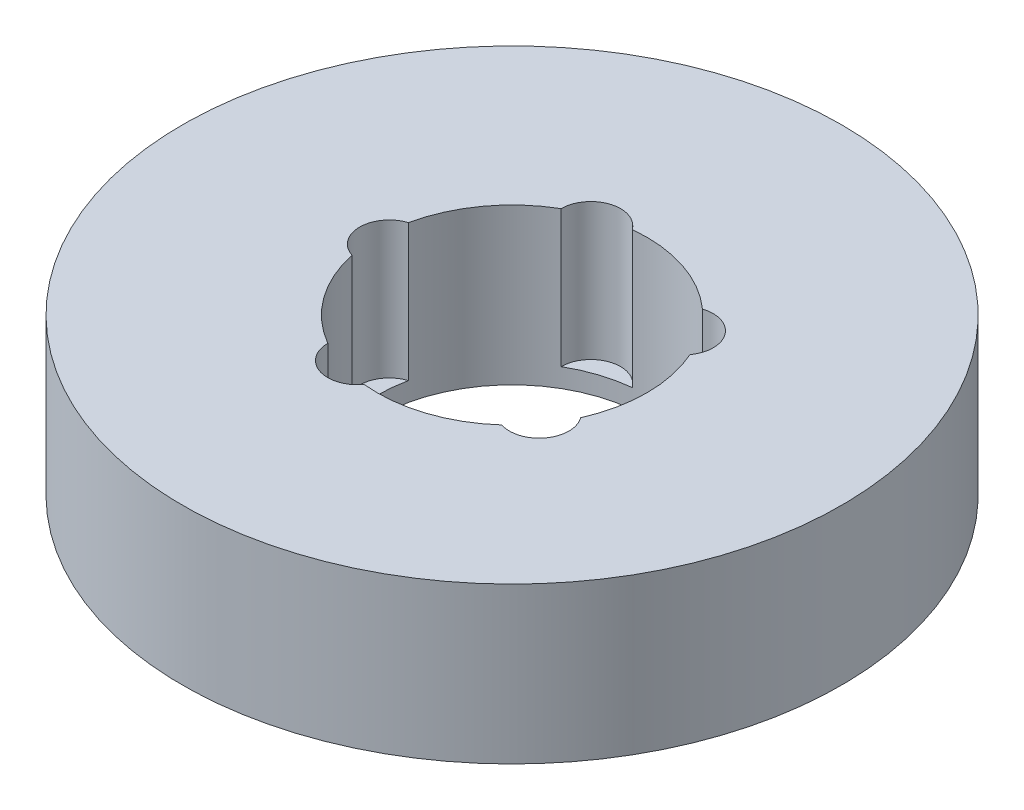
ISO-10303-21;
HEADER;
FILE_DESCRIPTION(('STEP AP214'),'2;1');
FILE_NAME('part.step','',(''),(''),'','','');
FILE_SCHEMA(('AUTOMOTIVE_DESIGN { 1 0 10303 214 1 1 1 1 }'));
ENDSEC;
DATA;
#1=APPLICATION_CONTEXT('core data for automotive mechanical design processes');
#2=APPLICATION_PROTOCOL_DEFINITION('international standard','automotive_design',2000,#1);
#3=PRODUCT_CONTEXT('',#1,'mechanical');
#4=PRODUCT('Part','Part','',(#3));
#5=PRODUCT_RELATED_PRODUCT_CATEGORY('part','',(#4));
#6=PRODUCT_DEFINITION_FORMATION('','',#4);
#7=PRODUCT_DEFINITION_CONTEXT('part definition',#1,'design');
#8=PRODUCT_DEFINITION('design','',#6,#7);
#9=PRODUCT_DEFINITION_SHAPE('','',#8);
#10=(LENGTH_UNIT() NAMED_UNIT(*) SI_UNIT(.MILLI.,.METRE.));
#11=(NAMED_UNIT(*) PLANE_ANGLE_UNIT() SI_UNIT($,.RADIAN.));
#12=(NAMED_UNIT(*) SI_UNIT($,.STERADIAN.) SOLID_ANGLE_UNIT());
#13=UNCERTAINTY_MEASURE_WITH_UNIT(LENGTH_MEASURE(1.E-05),#10,'distance_accuracy_value','');
#14=(GEOMETRIC_REPRESENTATION_CONTEXT(3) GLOBAL_UNCERTAINTY_ASSIGNED_CONTEXT((#13)) GLOBAL_UNIT_ASSIGNED_CONTEXT((#10,
#11,#12)) REPRESENTATION_CONTEXT('',''));
#15=CARTESIAN_POINT('',(0.,0.,0.));
#16=DIRECTION('',(0.,0.,1.));
#17=DIRECTION('',(1.,0.,0.));
#18=AXIS2_PLACEMENT_3D('',#15,#16,#17);
#19=CARTESIAN_POINT('',(0.,26.,0.));
#20=DIRECTION('',(0.,-1.,0.));
#21=DIRECTION('',(0.,0.,-1.));
#22=AXIS2_PLACEMENT_3D('',#19,#20,#21);
#23=CYLINDRICAL_SURFACE('',#22,55.);
#24=CARTESIAN_POINT('',(0.,26.,0.));
#25=DIRECTION('',(0.,1.,0.));
#26=DIRECTION('',(0.,0.,1.));
#27=AXIS2_PLACEMENT_3D('',#24,#25,#26);
#28=CIRCLE('',#27,55.);
#29=CARTESIAN_POINT('',(0.,26.,-55.));
#30=VERTEX_POINT('',#29);
#31=EDGE_CURVE('E151',#30,#30,#28,.T.);
#32=CARTESIAN_POINT('',(0.,0.,0.));
#33=DIRECTION('',(0.,1.,0.));
#34=DIRECTION('',(0.,0.,1.));
#35=AXIS2_PLACEMENT_3D('',#32,#33,#34);
#36=CIRCLE('',#35,55.);
#37=CARTESIAN_POINT('',(0.,0.,-55.));
#38=VERTEX_POINT('',#37);
#39=EDGE_CURVE('E150',#38,#38,#36,.T.);
#40=CARTESIAN_POINT('',(0.,26.,-55.));
#41=CARTESIAN_POINT('',(0.,25.7291666666667,-55.));
#42=CARTESIAN_POINT('',(0.,25.4583333333333,-55.));
#43=CARTESIAN_POINT('',(0.,24.9166666666667,-55.));
#44=CARTESIAN_POINT('',(0.,24.6458333333333,-55.));
#45=CARTESIAN_POINT('',(0.,24.1041666666667,-55.));
#46=CARTESIAN_POINT('',(0.,23.8333333333333,-55.));
#47=CARTESIAN_POINT('',(0.,23.2916666666667,-55.));
#48=CARTESIAN_POINT('',(0.,23.0208333333333,-55.));
#49=CARTESIAN_POINT('',(0.,22.4791666666667,-55.));
#50=CARTESIAN_POINT('',(0.,22.2083333333333,-55.));
#51=CARTESIAN_POINT('',(0.,21.6666666666667,-55.));
#52=CARTESIAN_POINT('',(0.,21.3958333333333,-55.));
#53=CARTESIAN_POINT('',(0.,20.8541666666667,-55.));
#54=CARTESIAN_POINT('',(0.,20.5833333333333,-55.));
#55=CARTESIAN_POINT('',(0.,20.0416666666667,-55.));
#56=CARTESIAN_POINT('',(0.,19.7708333333333,-55.));
#57=CARTESIAN_POINT('',(0.,19.2291666666667,-55.));
#58=CARTESIAN_POINT('',(0.,18.9583333333333,-55.));
#59=CARTESIAN_POINT('',(0.,18.4166666666667,-55.));
#60=CARTESIAN_POINT('',(0.,18.1458333333333,-55.));
#61=CARTESIAN_POINT('',(0.,17.6041666666667,-55.));
#62=CARTESIAN_POINT('',(0.,17.3333333333333,-55.));
#63=CARTESIAN_POINT('',(0.,16.7916666666667,-55.));
#64=CARTESIAN_POINT('',(0.,16.5208333333333,-55.));
#65=CARTESIAN_POINT('',(0.,15.9791666666667,-55.));
#66=CARTESIAN_POINT('',(0.,15.7083333333333,-55.));
#67=CARTESIAN_POINT('',(0.,15.1666666666667,-55.));
#68=CARTESIAN_POINT('',(0.,14.8958333333333,-55.));
#69=CARTESIAN_POINT('',(0.,14.3541666666667,-55.));
#70=CARTESIAN_POINT('',(0.,14.0833333333333,-55.));
#71=CARTESIAN_POINT('',(0.,13.5416666666667,-55.));
#72=CARTESIAN_POINT('',(0.,13.2708333333333,-55.));
#73=CARTESIAN_POINT('',(0.,12.7291666666667,-55.));
#74=CARTESIAN_POINT('',(0.,12.4583333333333,-55.));
#75=CARTESIAN_POINT('',(0.,11.9166666666667,-55.));
#76=CARTESIAN_POINT('',(0.,11.6458333333333,-55.));
#77=CARTESIAN_POINT('',(0.,11.1041666666667,-55.));
#78=CARTESIAN_POINT('',(0.,10.8333333333333,-55.));
#79=CARTESIAN_POINT('',(0.,10.2916666666667,-55.));
#80=CARTESIAN_POINT('',(0.,10.0208333333333,-55.));
#81=CARTESIAN_POINT('',(0.,9.47916666666667,-55.));
#82=CARTESIAN_POINT('',(0.,9.20833333333333,-55.));
#83=CARTESIAN_POINT('',(0.,8.66666666666667,-55.));
#84=CARTESIAN_POINT('',(0.,8.39583333333333,-55.));
#85=CARTESIAN_POINT('',(0.,7.85416666666667,-55.));
#86=CARTESIAN_POINT('',(0.,7.58333333333333,-55.));
#87=CARTESIAN_POINT('',(0.,7.04166666666667,-55.));
#88=CARTESIAN_POINT('',(0.,6.77083333333333,-55.));
#89=CARTESIAN_POINT('',(0.,6.22916666666667,-55.));
#90=CARTESIAN_POINT('',(0.,5.95833333333333,-55.));
#91=CARTESIAN_POINT('',(0.,5.41666666666667,-55.));
#92=CARTESIAN_POINT('',(0.,5.14583333333333,-55.));
#93=CARTESIAN_POINT('',(0.,4.60416666666667,-55.));
#94=CARTESIAN_POINT('',(0.,4.33333333333333,-55.));
#95=CARTESIAN_POINT('',(0.,3.79166666666667,-55.));
#96=CARTESIAN_POINT('',(0.,3.52083333333333,-55.));
#97=CARTESIAN_POINT('',(0.,2.97916666666667,-55.));
#98=CARTESIAN_POINT('',(0.,2.70833333333333,-55.));
#99=CARTESIAN_POINT('',(0.,2.16666666666667,-55.));
#100=CARTESIAN_POINT('',(0.,1.89583333333333,-55.));
#101=CARTESIAN_POINT('',(0.,1.35416666666667,-55.));
#102=CARTESIAN_POINT('',(0.,1.08333333333333,-55.));
#103=CARTESIAN_POINT('',(0.,0.541666666666667,-55.));
#104=CARTESIAN_POINT('',(0.,0.270833333333334,-55.));
#105=CARTESIAN_POINT('',(0.,0.,-55.));
#106=B_SPLINE_CURVE_WITH_KNOTS('',3,(#40,#41,#42,#43,#44,#45,#46,#47,#48,#49,#50,#51,#52,#53,
#54,#55,#56,#57,#58,#59,#60,#61,#62,#63,#64,#65,#66,#67,#68,#69,#70,#71,#72,#73,#74,#75,#76,#77,
#78,#79,#80,#81,#82,#83,#84,#85,#86,#87,#88,#89,#90,#91,#92,#93,#94,#95,#96,#97,#98,#99,#100,
#101,#102,#103,#104,#105),.UNSPECIFIED.,.F.,.F.,(4,2,2,2,2,2,2,2,2,2,2,2,2,2,2,2,2,2,2,2,2,2,2,
2,2,2,2,2,2,2,2,2,4),(0.,0.812500000000001,1.625,2.4375,3.25,4.0625,4.875,5.6875,6.5,7.3125,
8.125,8.9375,9.75,10.5625,11.375,12.1875,13.,13.8125,14.625,15.4375,16.25,17.0625,17.875,
18.6875,19.5,20.3125,21.125,21.9375,22.75,23.5625,24.375,25.1875,26.),.UNSPECIFIED.);
#107=EDGE_CURVE('BSEAM39',#30,#38,#106,.T.);
#108=ORIENTED_EDGE('',*,*,#31,.F.);
#109=ORIENTED_EDGE('',*,*,#39,.T.);
#110=ORIENTED_EDGE('',*,*,#107,.T.);
#111=ORIENTED_EDGE('',*,*,#107,.F.);
#112=EDGE_LOOP('',(#108,#110,#109,#111));
#113=FACE_BOUND('',#112,.T.);
#114=ADVANCED_FACE('F39',(#113),#23,.T.);
#115=CARTESIAN_POINT('',(0.,26.,0.));
#116=DIRECTION('',(0.,1.,0.));
#117=DIRECTION('',(0.,0.,1.));
#118=AXIS2_PLACEMENT_3D('',#115,#116,#117);
#119=PLANE('',#118);
#120=CARTESIAN_POINT('',(-6.33052670048163,26.,-19.4833578077199));
#121=DIRECTION('',(0.,1.,0.));
#122=DIRECTION('',(-0.95105651629515,0.,0.309016994374958));
#123=AXIS2_PLACEMENT_3D('',#120,#121,#122);
#124=CIRCLE('',#123,4.94975318121783);
#125=CARTESIAN_POINT('',(-2.31712644491207,26.,-22.3803691890525));
#126=VERTEX_POINT('',#125);
#127=CARTESIAN_POINT('',(-11.2802562781369,26.,-19.4680717663449));
#128=VERTEX_POINT('',#127);
#129=EDGE_CURVE('E196',#126,#128,#124,.T.);
#130=ORIENTED_EDGE('',*,*,#129,.F.);
#131=CARTESIAN_POINT('',(0.,26.,0.));
#132=DIRECTION('',(0.,1.,0.));
#133=DIRECTION('',(0.,0.,1.));
#134=AXIS2_PLACEMENT_3D('',#131,#132,#133);
#135=CIRCLE('',#134,22.5);
#136=CARTESIAN_POINT('',(15.029445622235,26.,-16.744126262313));
#137=VERTEX_POINT('',#136);
#138=EDGE_CURVE('E156',#137,#126,#135,.T.);
#139=ORIENTED_EDGE('',*,*,#138,.F.);
#140=CARTESIAN_POINT('',(16.5735340685489,26.,-12.0413773401468));
#141=DIRECTION('',(0.,1.,0.));
#142=DIRECTION('',(-0.58778525229248,0.,-0.809016994374942));
#143=AXIS2_PLACEMENT_3D('',#140,#141,#142);
#144=CIRCLE('',#143,4.94975318121783);
#145=CARTESIAN_POINT('',(20.5689645047462,26.,-9.11963262431607));
#146=VERTEX_POINT('',#145);
#147=EDGE_CURVE('E254',#146,#137,#144,.T.);
#148=ORIENTED_EDGE('',*,*,#147,.F.);
#149=CARTESIAN_POINT('',(20.5689645047464,26.,9.11963262431577));
#150=VERTEX_POINT('',#149);
#151=EDGE_CURVE('E153',#150,#146,#135,.T.);
#152=ORIENTED_EDGE('',*,*,#151,.F.);
#153=CARTESIAN_POINT('',(16.5735340685491,26.,12.0413773401465));
#154=DIRECTION('',(0.,1.,0.));
#155=DIRECTION('',(0.587785252292469,0.,-0.809016994374951));
#156=AXIS2_PLACEMENT_3D('',#153,#154,#155);
#157=CIRCLE('',#156,4.94975318121783);
#158=CARTESIAN_POINT('',(15.0294456222353,26.,16.7441262623128));
#159=VERTEX_POINT('',#158);
#160=EDGE_CURVE('E248',#159,#150,#157,.T.);
#161=ORIENTED_EDGE('',*,*,#160,.F.);
#162=CARTESIAN_POINT('',(-2.31712644491175,26.,22.3803691890525));
#163=VERTEX_POINT('',#162);
#164=EDGE_CURVE('E140',#163,#159,#135,.T.);
#165=ORIENTED_EDGE('',*,*,#164,.F.);
#166=CARTESIAN_POINT('',(-6.33052670048136,26.,19.48335780772));
#167=DIRECTION('',(0.,1.,0.));
#168=DIRECTION('',(0.951056516295155,0.,0.309016994374945));
#169=AXIS2_PLACEMENT_3D('',#166,#167,#168);
#170=CIRCLE('',#169,4.94975318121783);
#171=CARTESIAN_POINT('',(-11.2802562781366,26.,19.468071766345));
#172=VERTEX_POINT('',#171);
#173=EDGE_CURVE('E117',#172,#163,#170,.T.);
#174=ORIENTED_EDGE('',*,*,#173,.F.);
#175=CARTESIAN_POINT('',(-22.001027403933,26.,4.71219621528948));
#176=VERTEX_POINT('',#175);
#177=EDGE_CURVE('E133',#176,#172,#135,.T.);
#178=ORIENTED_EDGE('',*,*,#177,.F.);
#179=CARTESIAN_POINT('',(-20.4860147361353,26.,0.));
#180=DIRECTION('',(0.,1.,0.));
#181=DIRECTION('',(0.,0.,1.));
#182=AXIS2_PLACEMENT_3D('',#179,#180,#181);
#183=CIRCLE('',#182,4.94975318121783);
#184=CARTESIAN_POINT('',(-22.001027403933,26.,-4.71219621528948));
#185=VERTEX_POINT('',#184);
#186=EDGE_CURVE('E170',#185,#176,#183,.T.);
#187=ORIENTED_EDGE('',*,*,#186,.F.);
#188=EDGE_CURVE('E149',#128,#185,#135,.T.);
#189=ORIENTED_EDGE('',*,*,#188,.F.);
#190=EDGE_LOOP('',(#130,#139,#148,#152,#161,#165,#174,#178,#187,#189));
#191=FACE_BOUND('',#190,.T.);
#192=ORIENTED_EDGE('',*,*,#31,.T.);
#193=EDGE_LOOP('',(#192));
#194=FACE_BOUND('',#193,.T.);
#195=ADVANCED_FACE('F131',(#191,#194),#119,.T.);
#196=CARTESIAN_POINT('',(0.,0.,0.));
#197=DIRECTION('',(0.,1.,0.));
#198=DIRECTION('',(0.,0.,1.));
#199=AXIS2_PLACEMENT_3D('',#196,#197,#198);
#200=PLANE('',#199);
#201=CARTESIAN_POINT('',(0.,0.,0.));
#202=DIRECTION('',(0.,1.,0.));
#203=DIRECTION('',(0.,0.,1.));
#204=AXIS2_PLACEMENT_3D('',#201,#202,#203);
#205=CIRCLE('',#204,22.5);
#206=CARTESIAN_POINT('',(0.,0.,22.5));
#207=VERTEX_POINT('',#206);
#208=EDGE_CURVE('E160',#207,#207,#205,.T.);
#209=ORIENTED_EDGE('',*,*,#208,.T.);
#210=EDGE_LOOP('',(#209));
#211=FACE_BOUND('',#210,.T.);
#212=ORIENTED_EDGE('',*,*,#39,.F.);
#213=EDGE_LOOP('',(#212));
#214=FACE_BOUND('',#213,.T.);
#215=ADVANCED_FACE('F212',(#211,#214),#200,.F.);
#216=CARTESIAN_POINT('',(0.,26.,0.));
#217=DIRECTION('',(0.,-1.,0.));
#218=DIRECTION('',(0.,0.,-1.));
#219=AXIS2_PLACEMENT_3D('',#216,#217,#218);
#220=CYLINDRICAL_SURFACE('',#219,22.5);
#221=DIRECTION('',(0.,1.,0.));
#222=VECTOR('',#221,1.);
#223=CARTESIAN_POINT('',(-2.31712644491207,14.5820139163583,-22.3803691890525));
#224=LINE('',#223,#222);
#225=CARTESIAN_POINT('',(-2.31712644491207,3.16402783271657,-22.3803691890525));
#226=VERTEX_POINT('',#225);
#227=EDGE_CURVE('E11',#226,#126,#224,.T.);
#228=ORIENTED_EDGE('',*,*,#227,.F.);
#229=CARTESIAN_POINT('',(0.,3.16402783271657,0.));
#230=DIRECTION('',(0.,1.,0.));
#231=DIRECTION('',(0.,0.,1.));
#232=AXIS2_PLACEMENT_3D('',#229,#230,#231);
#233=CIRCLE('',#232,22.5);
#234=CARTESIAN_POINT('',(-11.2802562781369,3.16402783271657,-19.4680717663449));
#235=VERTEX_POINT('',#234);
#236=EDGE_CURVE('E193',#226,#235,#233,.T.);
#237=ORIENTED_EDGE('',*,*,#236,.T.);
#238=DIRECTION('',(0.,1.,0.));
#239=VECTOR('',#238,1.);
#240=CARTESIAN_POINT('',(-11.2802562781369,14.5820139163583,-19.4680717663449));
#241=LINE('',#240,#239);
#242=EDGE_CURVE('E46',#128,#235,#241,.F.);
#243=ORIENTED_EDGE('',*,*,#242,.F.);
#244=ORIENTED_EDGE('',*,*,#188,.T.);
#245=DIRECTION('',(0.,1.,0.));
#246=VECTOR('',#245,1.);
#247=CARTESIAN_POINT('',(-22.001027403933,14.5820139163583,-4.71219621528948));
#248=LINE('',#247,#246);
#249=CARTESIAN_POINT('',(-22.001027403933,3.16402783271657,-4.71219621528948));
#250=VERTEX_POINT('',#249);
#251=EDGE_CURVE('E174',#250,#185,#248,.T.);
#252=ORIENTED_EDGE('',*,*,#251,.F.);
#253=CARTESIAN_POINT('',(0.,3.16402783271657,0.));
#254=DIRECTION('',(0.,1.,0.));
#255=DIRECTION('',(0.,0.,1.));
#256=AXIS2_PLACEMENT_3D('',#253,#254,#255);
#257=CIRCLE('',#256,22.5);
#258=CARTESIAN_POINT('',(-22.001027403933,3.16402783271657,4.71219621528948));
#259=VERTEX_POINT('',#258);
#260=EDGE_CURVE('E171',#250,#259,#257,.T.);
#261=ORIENTED_EDGE('',*,*,#260,.T.);
#262=DIRECTION('',(0.,1.,0.));
#263=VECTOR('',#262,1.);
#264=CARTESIAN_POINT('',(-22.001027403933,14.5820139163583,4.71219621528948));
#265=LINE('',#264,#263);
#266=EDGE_CURVE('E148',#176,#259,#265,.F.);
#267=ORIENTED_EDGE('',*,*,#266,.F.);
#268=ORIENTED_EDGE('',*,*,#177,.T.);
#269=DIRECTION('',(0.,1.,0.));
#270=VECTOR('',#269,1.);
#271=CARTESIAN_POINT('',(-11.2802562781366,14.5820139163583,19.468071766345));
#272=LINE('',#271,#270);
#273=CARTESIAN_POINT('',(-11.2802562781366,3.16402783271657,19.468071766345));
#274=VERTEX_POINT('',#273);
#275=EDGE_CURVE('E111',#274,#172,#272,.T.);
#276=ORIENTED_EDGE('',*,*,#275,.F.);
#277=CARTESIAN_POINT('',(0.,3.16402783271657,0.));
#278=DIRECTION('',(0.,1.,0.));
#279=DIRECTION('',(0.,0.,1.));
#280=AXIS2_PLACEMENT_3D('',#277,#278,#279);
#281=CIRCLE('',#280,22.5);
#282=CARTESIAN_POINT('',(-2.31712644491175,3.16402783271657,22.3803691890525));
#283=VERTEX_POINT('',#282);
#284=EDGE_CURVE('E180',#274,#283,#281,.T.);
#285=ORIENTED_EDGE('',*,*,#284,.T.);
#286=DIRECTION('',(0.,1.,0.));
#287=VECTOR('',#286,1.);
#288=CARTESIAN_POINT('',(-2.31712644491175,14.5820139163583,22.3803691890525));
#289=LINE('',#288,#287);
#290=EDGE_CURVE('E124',#163,#283,#289,.F.);
#291=ORIENTED_EDGE('',*,*,#290,.F.);
#292=ORIENTED_EDGE('',*,*,#164,.T.);
#293=DIRECTION('',(0.,1.,0.));
#294=VECTOR('',#293,1.);
#295=CARTESIAN_POINT('',(15.0294456222353,14.5820139163583,16.7441262623128));
#296=LINE('',#295,#294);
#297=CARTESIAN_POINT('',(15.0294456222353,3.16402783271657,16.7441262623128));
#298=VERTEX_POINT('',#297);
#299=EDGE_CURVE('E183',#298,#159,#296,.T.);
#300=ORIENTED_EDGE('',*,*,#299,.F.);
#301=CARTESIAN_POINT('',(0.,3.16402783271657,0.));
#302=DIRECTION('',(0.,1.,0.));
#303=DIRECTION('',(0.,0.,1.));
#304=AXIS2_PLACEMENT_3D('',#301,#302,#303);
#305=CIRCLE('',#304,22.5);
#306=CARTESIAN_POINT('',(20.5689645047464,3.16402783271657,9.11963262431577));
#307=VERTEX_POINT('',#306);
#308=EDGE_CURVE('E123',#298,#307,#305,.T.);
#309=ORIENTED_EDGE('',*,*,#308,.T.);
#310=DIRECTION('',(0.,1.,0.));
#311=VECTOR('',#310,1.);
#312=CARTESIAN_POINT('',(20.5689645047464,14.5820139163583,9.11963262431577));
#313=LINE('',#312,#311);
#314=EDGE_CURVE('E185',#150,#307,#313,.F.);
#315=ORIENTED_EDGE('',*,*,#314,.F.);
#316=ORIENTED_EDGE('',*,*,#151,.T.);
#317=DIRECTION('',(0.,1.,0.));
#318=VECTOR('',#317,1.);
#319=CARTESIAN_POINT('',(20.5689645047462,14.5820139163583,-9.11963262431607));
#320=LINE('',#319,#318);
#321=CARTESIAN_POINT('',(20.5689645047462,3.16402783271657,-9.11963262431607));
#322=VERTEX_POINT('',#321);
#323=EDGE_CURVE('E195',#322,#146,#320,.T.);
#324=ORIENTED_EDGE('',*,*,#323,.F.);
#325=CARTESIAN_POINT('',(0.,3.16402783271657,0.));
#326=DIRECTION('',(0.,1.,0.));
#327=DIRECTION('',(0.,0.,1.));
#328=AXIS2_PLACEMENT_3D('',#325,#326,#327);
#329=CIRCLE('',#328,22.5);
#330=CARTESIAN_POINT('',(15.029445622235,3.16402783271657,-16.744126262313));
#331=VERTEX_POINT('',#330);
#332=EDGE_CURVE('E190',#322,#331,#329,.T.);
#333=ORIENTED_EDGE('',*,*,#332,.T.);
#334=DIRECTION('',(0.,1.,0.));
#335=VECTOR('',#334,1.);
#336=CARTESIAN_POINT('',(15.029445622235,14.5820139163583,-16.744126262313));
#337=LINE('',#336,#335);
#338=EDGE_CURVE('E189',#137,#331,#337,.F.);
#339=ORIENTED_EDGE('',*,*,#338,.F.);
#340=ORIENTED_EDGE('',*,*,#138,.T.);
#341=EDGE_LOOP('',(#228,#237,#243,#244,#252,#261,#267,#268,#276,#285,#291,#292,#300,#309,#315,
#316,#324,#333,#339,#340));
#342=FACE_BOUND('',#341,.T.);
#343=ORIENTED_EDGE('',*,*,#208,.F.);
#344=EDGE_LOOP('',(#343));
#345=FACE_BOUND('',#344,.T.);
#346=ADVANCED_FACE('F142',(#342,#345),#220,.F.);
#347=CARTESIAN_POINT('',(-20.4860147361353,3.16402783271657,0.));
#348=DIRECTION('',(0.,1.,0.));
#349=DIRECTION('',(0.,0.,1.));
#350=AXIS2_PLACEMENT_3D('',#347,#348,#349);
#351=CYLINDRICAL_SURFACE('',#350,4.94975318121783);
#352=ORIENTED_EDGE('',*,*,#251,.T.);
#353=ORIENTED_EDGE('',*,*,#186,.T.);
#354=ORIENTED_EDGE('',*,*,#266,.T.);
#355=CARTESIAN_POINT('',(-20.4860147361353,3.16402783271657,0.));
#356=DIRECTION('',(0.,1.,0.));
#357=DIRECTION('',(0.,0.,1.));
#358=AXIS2_PLACEMENT_3D('',#355,#356,#357);
#359=CIRCLE('',#358,4.94975318121783);
#360=EDGE_CURVE('E163',#250,#259,#359,.T.);
#361=ORIENTED_EDGE('',*,*,#360,.F.);
#362=EDGE_LOOP('',(#352,#353,#354,#361));
#363=FACE_BOUND('',#362,.T.);
#364=ADVANCED_FACE('F221',(#363),#351,.F.);
#365=CARTESIAN_POINT('',(-20.4860147361353,3.16402783271657,0.));
#366=DIRECTION('',(0.,1.,0.));
#367=DIRECTION('',(0.,0.,1.));
#368=AXIS2_PLACEMENT_3D('',#365,#366,#367);
#369=PLANE('',#368);
#370=ORIENTED_EDGE('',*,*,#360,.T.);
#371=ORIENTED_EDGE('',*,*,#260,.F.);
#372=EDGE_LOOP('',(#370,#371));
#373=FACE_BOUND('',#372,.T.);
#374=ADVANCED_FACE('F227',(#373),#369,.T.);
#375=CARTESIAN_POINT('',(-6.33052670048136,3.16402783271657,19.48335780772));
#376=DIRECTION('',(0.,1.,0.));
#377=DIRECTION('',(0.,0.,1.));
#378=AXIS2_PLACEMENT_3D('',#375,#376,#377);
#379=CYLINDRICAL_SURFACE('',#378,4.94975318121783);
#380=ORIENTED_EDGE('',*,*,#275,.T.);
#381=ORIENTED_EDGE('',*,*,#173,.T.);
#382=ORIENTED_EDGE('',*,*,#290,.T.);
#383=CARTESIAN_POINT('',(-6.33052670048136,3.16402783271657,19.48335780772));
#384=DIRECTION('',(0.,1.,0.));
#385=DIRECTION('',(0.951056516295155,0.,0.309016994374945));
#386=AXIS2_PLACEMENT_3D('',#383,#384,#385);
#387=CIRCLE('',#386,4.94975318121783);
#388=EDGE_CURVE('E119',#274,#283,#387,.T.);
#389=ORIENTED_EDGE('',*,*,#388,.F.);
#390=EDGE_LOOP('',(#380,#381,#382,#389));
#391=FACE_BOUND('',#390,.T.);
#392=ADVANCED_FACE('F116',(#391),#379,.F.);
#393=CARTESIAN_POINT('',(-6.33052670048136,3.16402783271657,19.48335780772));
#394=DIRECTION('',(0.,1.,0.));
#395=DIRECTION('',(0.951056516295155,0.,0.309016994374945));
#396=AXIS2_PLACEMENT_3D('',#393,#394,#395);
#397=PLANE('',#396);
#398=ORIENTED_EDGE('',*,*,#388,.T.);
#399=ORIENTED_EDGE('',*,*,#284,.F.);
#400=EDGE_LOOP('',(#398,#399));
#401=FACE_BOUND('',#400,.T.);
#402=ADVANCED_FACE('F234',(#401),#397,.T.);
#403=CARTESIAN_POINT('',(16.5735340685491,3.16402783271657,12.0413773401465));
#404=DIRECTION('',(0.,1.,0.));
#405=DIRECTION('',(0.,0.,1.));
#406=AXIS2_PLACEMENT_3D('',#403,#404,#405);
#407=CYLINDRICAL_SURFACE('',#406,4.94975318121783);
#408=ORIENTED_EDGE('',*,*,#299,.T.);
#409=ORIENTED_EDGE('',*,*,#160,.T.);
#410=ORIENTED_EDGE('',*,*,#314,.T.);
#411=CARTESIAN_POINT('',(16.5735340685491,3.16402783271657,12.0413773401465));
#412=DIRECTION('',(0.,1.,0.));
#413=DIRECTION('',(0.587785252292469,0.,-0.809016994374951));
#414=AXIS2_PLACEMENT_3D('',#411,#412,#413);
#415=CIRCLE('',#414,4.94975318121783);
#416=EDGE_CURVE('E137',#298,#307,#415,.T.);
#417=ORIENTED_EDGE('',*,*,#416,.F.);
#418=EDGE_LOOP('',(#408,#409,#410,#417));
#419=FACE_BOUND('',#418,.T.);
#420=ADVANCED_FACE('F240',(#419),#407,.F.);
#421=CARTESIAN_POINT('',(16.5735340685491,3.16402783271657,12.0413773401465));
#422=DIRECTION('',(0.,1.,0.));
#423=DIRECTION('',(0.587785252292469,0.,-0.809016994374951));
#424=AXIS2_PLACEMENT_3D('',#421,#422,#423);
#425=PLANE('',#424);
#426=ORIENTED_EDGE('',*,*,#416,.T.);
#427=ORIENTED_EDGE('',*,*,#308,.F.);
#428=EDGE_LOOP('',(#426,#427));
#429=FACE_BOUND('',#428,.T.);
#430=ADVANCED_FACE('F245',(#429),#425,.T.);
#431=CARTESIAN_POINT('',(16.5735340685489,3.16402783271657,-12.0413773401468));
#432=DIRECTION('',(0.,1.,0.));
#433=DIRECTION('',(0.,0.,1.));
#434=AXIS2_PLACEMENT_3D('',#431,#432,#433);
#435=CYLINDRICAL_SURFACE('',#434,4.94975318121783);
#436=ORIENTED_EDGE('',*,*,#323,.T.);
#437=ORIENTED_EDGE('',*,*,#147,.T.);
#438=ORIENTED_EDGE('',*,*,#338,.T.);
#439=CARTESIAN_POINT('',(16.5735340685489,3.16402783271657,-12.0413773401468));
#440=DIRECTION('',(0.,1.,0.));
#441=DIRECTION('',(-0.58778525229248,0.,-0.809016994374942));
#442=AXIS2_PLACEMENT_3D('',#439,#440,#441);
#443=CIRCLE('',#442,4.94975318121783);
#444=EDGE_CURVE('E56',#322,#331,#443,.T.);
#445=ORIENTED_EDGE('',*,*,#444,.F.);
#446=EDGE_LOOP('',(#436,#437,#438,#445));
#447=FACE_BOUND('',#446,.T.);
#448=ADVANCED_FACE('F264',(#447),#435,.F.);
#449=CARTESIAN_POINT('',(16.5735340685489,3.16402783271657,-12.0413773401468));
#450=DIRECTION('',(0.,1.,0.));
#451=DIRECTION('',(-0.58778525229248,0.,-0.809016994374942));
#452=AXIS2_PLACEMENT_3D('',#449,#450,#451);
#453=PLANE('',#452);
#454=ORIENTED_EDGE('',*,*,#444,.T.);
#455=ORIENTED_EDGE('',*,*,#332,.F.);
#456=EDGE_LOOP('',(#454,#455));
#457=FACE_BOUND('',#456,.T.);
#458=ADVANCED_FACE('F202',(#457),#453,.T.);
#459=CARTESIAN_POINT('',(-6.33052670048163,3.16402783271657,-19.4833578077199));
#460=DIRECTION('',(0.,1.,0.));
#461=DIRECTION('',(0.,0.,1.));
#462=AXIS2_PLACEMENT_3D('',#459,#460,#461);
#463=CYLINDRICAL_SURFACE('',#462,4.94975318121783);
#464=ORIENTED_EDGE('',*,*,#227,.T.);
#465=ORIENTED_EDGE('',*,*,#129,.T.);
#466=ORIENTED_EDGE('',*,*,#242,.T.);
#467=CARTESIAN_POINT('',(-6.33052670048163,3.16402783271657,-19.4833578077199));
#468=DIRECTION('',(0.,1.,0.));
#469=DIRECTION('',(-0.95105651629515,0.,0.309016994374958));
#470=AXIS2_PLACEMENT_3D('',#467,#468,#469);
#471=CIRCLE('',#470,4.94975318121783);
#472=EDGE_CURVE('E55',#226,#235,#471,.T.);
#473=ORIENTED_EDGE('',*,*,#472,.F.);
#474=EDGE_LOOP('',(#464,#465,#466,#473));
#475=FACE_BOUND('',#474,.T.);
#476=ADVANCED_FACE('F197',(#475),#463,.F.);
#477=CARTESIAN_POINT('',(-6.33052670048163,3.16402783271657,-19.4833578077199));
#478=DIRECTION('',(0.,1.,0.));
#479=DIRECTION('',(-0.95105651629515,0.,0.309016994374958));
#480=AXIS2_PLACEMENT_3D('',#477,#478,#479);
#481=PLANE('',#480);
#482=ORIENTED_EDGE('',*,*,#472,.T.);
#483=ORIENTED_EDGE('',*,*,#236,.F.);
#484=EDGE_LOOP('',(#482,#483));
#485=FACE_BOUND('',#484,.T.);
#486=ADVANCED_FACE('F200',(#485),#481,.T.);
#487=CLOSED_SHELL('',(#114,#195,#215,#346,#364,#374,#392,#402,#420,#430,#448,#458,#476,#486));
#488=MANIFOLD_SOLID_BREP('B2',#487);
#489=ADVANCED_BREP_SHAPE_REPRESENTATION('',(#18,#488),#14);
#490=SHAPE_DEFINITION_REPRESENTATION(#9,#489);
ENDSEC;
END-ISO-10303-21;
